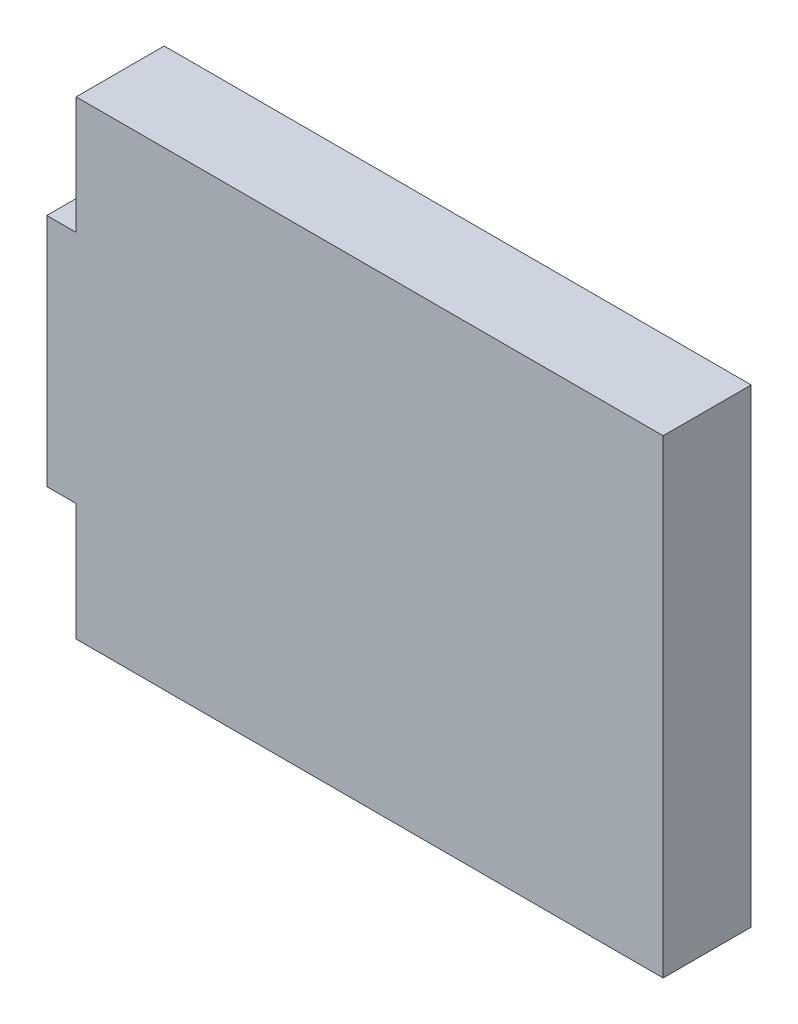
ISO-10303-21;
HEADER;
FILE_DESCRIPTION(('STEP AP214'),'2;1');
FILE_NAME('part.step','',(''),(''),'','','');
FILE_SCHEMA(('AUTOMOTIVE_DESIGN { 1 0 10303 214 1 1 1 1 }'));
ENDSEC;
DATA;
#1=APPLICATION_CONTEXT('core data for automotive mechanical design processes');
#2=APPLICATION_PROTOCOL_DEFINITION('international standard','automotive_design',2000,#1);
#3=PRODUCT_CONTEXT('',#1,'mechanical');
#4=PRODUCT('Part','Part','',(#3));
#5=PRODUCT_RELATED_PRODUCT_CATEGORY('part','',(#4));
#6=PRODUCT_DEFINITION_FORMATION('','',#4);
#7=PRODUCT_DEFINITION_CONTEXT('part definition',#1,'design');
#8=PRODUCT_DEFINITION('design','',#6,#7);
#9=PRODUCT_DEFINITION_SHAPE('','',#8);
#10=(LENGTH_UNIT() NAMED_UNIT(*) SI_UNIT(.MILLI.,.METRE.));
#11=(NAMED_UNIT(*) PLANE_ANGLE_UNIT() SI_UNIT($,.RADIAN.));
#12=(NAMED_UNIT(*) SI_UNIT($,.STERADIAN.) SOLID_ANGLE_UNIT());
#13=UNCERTAINTY_MEASURE_WITH_UNIT(LENGTH_MEASURE(1.E-05),#10,'distance_accuracy_value','');
#14=(GEOMETRIC_REPRESENTATION_CONTEXT(3) GLOBAL_UNCERTAINTY_ASSIGNED_CONTEXT((#13)) GLOBAL_UNIT_ASSIGNED_CONTEXT((#10,
#11,#12)) REPRESENTATION_CONTEXT('',''));
#15=CARTESIAN_POINT('',(0.,0.,0.));
#16=DIRECTION('',(0.,0.,1.));
#17=DIRECTION('',(1.,0.,0.));
#18=AXIS2_PLACEMENT_3D('',#15,#16,#17);
#19=CARTESIAN_POINT('',(-19.095,-10.35,2.));
#20=DIRECTION('',(0.,1.,0.));
#21=DIRECTION('',(0.,0.,1.));
#22=AXIS2_PLACEMENT_3D('',#19,#20,#21);
#23=PLANE('',#22);
#24=DIRECTION('',(0.,0.,-1.));
#25=VECTOR('',#24,1.);
#26=CARTESIAN_POINT('',(-19.095,-10.35,2.));
#27=LINE('',#26,#25);
#28=CARTESIAN_POINT('',(-19.095,-10.35,5.));
#29=VERTEX_POINT('',#28);
#30=CARTESIAN_POINT('',(-19.095,-10.35,2.));
#31=VERTEX_POINT('',#30);
#32=EDGE_CURVE('E120',#29,#31,#27,.T.);
#33=ORIENTED_EDGE('',*,*,#32,.T.);
#34=DIRECTION('',(1.,0.,0.));
#35=VECTOR('',#34,1.);
#36=CARTESIAN_POINT('',(-19.095,-10.35,2.));
#37=LINE('',#36,#35);
#38=CARTESIAN_POINT('',(-18.095,-10.35,2.));
#39=VERTEX_POINT('',#38);
#40=EDGE_CURVE('E20',#39,#31,#37,.F.);
#41=ORIENTED_EDGE('',*,*,#40,.F.);
#42=DIRECTION('',(0.,0.,-1.));
#43=VECTOR('',#42,1.);
#44=CARTESIAN_POINT('',(-18.095,-10.35,2.));
#45=LINE('',#44,#43);
#46=CARTESIAN_POINT('',(-18.095,-10.35,5.));
#47=VERTEX_POINT('',#46);
#48=EDGE_CURVE('E147',#39,#47,#45,.F.);
#49=ORIENTED_EDGE('',*,*,#48,.T.);
#50=DIRECTION('',(-1.,0.,0.));
#51=VECTOR('',#50,1.);
#52=CARTESIAN_POINT('',(1.905,-10.35,5.));
#53=LINE('',#52,#51);
#54=EDGE_CURVE('E109',#47,#29,#53,.T.);
#55=ORIENTED_EDGE('',*,*,#54,.T.);
#56=EDGE_LOOP('',(#33,#41,#49,#55));
#57=FACE_BOUND('',#56,.T.);
#58=ADVANCED_FACE('F17',(#57),#23,.F.);
#59=CARTESIAN_POINT('',(-18.095,-2.35,2.));
#60=DIRECTION('',(0.,-1.,0.));
#61=DIRECTION('',(0.,0.,-1.));
#62=AXIS2_PLACEMENT_3D('',#59,#60,#61);
#63=PLANE('',#62);
#64=DIRECTION('',(0.,0.,-1.));
#65=VECTOR('',#64,1.);
#66=CARTESIAN_POINT('',(-18.095,-2.35,2.));
#67=LINE('',#66,#65);
#68=CARTESIAN_POINT('',(-18.095,-2.35,5.));
#69=VERTEX_POINT('',#68);
#70=CARTESIAN_POINT('',(-18.095,-2.35,2.));
#71=VERTEX_POINT('',#70);
#72=EDGE_CURVE('E141',#69,#71,#67,.T.);
#73=ORIENTED_EDGE('',*,*,#72,.T.);
#74=DIRECTION('',(1.,0.,0.));
#75=VECTOR('',#74,1.);
#76=CARTESIAN_POINT('',(-18.095,-2.35,2.));
#77=LINE('',#76,#75);
#78=CARTESIAN_POINT('',(-19.095,-2.35,2.));
#79=VERTEX_POINT('',#78);
#80=EDGE_CURVE('E34',#79,#71,#77,.T.);
#81=ORIENTED_EDGE('',*,*,#80,.F.);
#82=DIRECTION('',(0.,0.,-1.));
#83=VECTOR('',#82,1.);
#84=CARTESIAN_POINT('',(-19.095,-2.35,2.));
#85=LINE('',#84,#83);
#86=CARTESIAN_POINT('',(-19.095,-2.35,5.));
#87=VERTEX_POINT('',#86);
#88=EDGE_CURVE('E125',#79,#87,#85,.F.);
#89=ORIENTED_EDGE('',*,*,#88,.T.);
#90=DIRECTION('',(-1.,0.,0.));
#91=VECTOR('',#90,1.);
#92=CARTESIAN_POINT('',(1.905,-2.35,5.));
#93=LINE('',#92,#91);
#94=EDGE_CURVE('E92',#87,#69,#93,.F.);
#95=ORIENTED_EDGE('',*,*,#94,.T.);
#96=EDGE_LOOP('',(#73,#81,#89,#95));
#97=FACE_BOUND('',#96,.T.);
#98=ADVANCED_FACE('F160',(#97),#63,.F.);
#99=CARTESIAN_POINT('',(1.905,1.65,5.));
#100=DIRECTION('',(0.,0.,-1.));
#101=DIRECTION('',(-1.,0.,0.));
#102=AXIS2_PLACEMENT_3D('',#99,#100,#101);
#103=PLANE('',#102);
#104=ORIENTED_EDGE('',*,*,#94,.F.);
#105=DIRECTION('',(0.,1.,0.));
#106=VECTOR('',#105,1.);
#107=CARTESIAN_POINT('',(-19.095,-2.35,5.));
#108=LINE('',#107,#106);
#109=EDGE_CURVE('E143',#87,#29,#108,.F.);
#110=ORIENTED_EDGE('',*,*,#109,.T.);
#111=ORIENTED_EDGE('',*,*,#54,.F.);
#112=DIRECTION('',(0.,1.,0.));
#113=VECTOR('',#112,1.);
#114=CARTESIAN_POINT('',(-18.095,-10.35,5.));
#115=LINE('',#114,#113);
#116=CARTESIAN_POINT('',(-18.095,-14.35,5.));
#117=VERTEX_POINT('',#116);
#118=EDGE_CURVE('E126',#47,#117,#115,.F.);
#119=ORIENTED_EDGE('',*,*,#118,.T.);
#120=DIRECTION('',(1.,0.,0.));
#121=VECTOR('',#120,1.);
#122=CARTESIAN_POINT('',(-18.095,-14.35,5.));
#123=LINE('',#122,#121);
#124=CARTESIAN_POINT('',(1.905,-14.35,5.));
#125=VERTEX_POINT('',#124);
#126=EDGE_CURVE('E97',#117,#125,#123,.T.);
#127=ORIENTED_EDGE('',*,*,#126,.T.);
#128=DIRECTION('',(0.,1.,0.));
#129=VECTOR('',#128,1.);
#130=CARTESIAN_POINT('',(1.905,-14.35,5.));
#131=LINE('',#130,#129);
#132=CARTESIAN_POINT('',(1.905,1.65,5.));
#133=VERTEX_POINT('',#132);
#134=EDGE_CURVE('E78',#125,#133,#131,.T.);
#135=ORIENTED_EDGE('',*,*,#134,.T.);
#136=DIRECTION('',(1.,0.,0.));
#137=VECTOR('',#136,1.);
#138=CARTESIAN_POINT('',(1.905,1.65,5.));
#139=LINE('',#138,#137);
#140=CARTESIAN_POINT('',(-18.095,1.65,5.));
#141=VERTEX_POINT('',#140);
#142=EDGE_CURVE('E83',#133,#141,#139,.F.);
#143=ORIENTED_EDGE('',*,*,#142,.T.);
#144=DIRECTION('',(0.,1.,0.));
#145=VECTOR('',#144,1.);
#146=CARTESIAN_POINT('',(-18.095,1.65,5.));
#147=LINE('',#146,#145);
#148=EDGE_CURVE('E138',#141,#69,#147,.F.);
#149=ORIENTED_EDGE('',*,*,#148,.T.);
#150=EDGE_LOOP('',(#104,#110,#111,#119,#127,#135,#143,#149));
#151=FACE_BOUND('',#150,.T.);
#152=ADVANCED_FACE('F95',(#151),#103,.F.);
#153=CARTESIAN_POINT('',(1.905,1.65,2.));
#154=DIRECTION('',(0.,-1.,0.));
#155=DIRECTION('',(0.,0.,-1.));
#156=AXIS2_PLACEMENT_3D('',#153,#154,#155);
#157=PLANE('',#156);
#158=DIRECTION('',(0.,0.,1.));
#159=VECTOR('',#158,1.);
#160=CARTESIAN_POINT('',(1.905,1.65,2.));
#161=LINE('',#160,#159);
#162=CARTESIAN_POINT('',(1.905,1.65,2.));
#163=VERTEX_POINT('',#162);
#164=EDGE_CURVE('E85',#133,#163,#161,.F.);
#165=ORIENTED_EDGE('',*,*,#164,.T.);
#166=DIRECTION('',(-1.,0.,0.));
#167=VECTOR('',#166,1.);
#168=CARTESIAN_POINT('',(1.905,1.65,2.));
#169=LINE('',#168,#167);
#170=CARTESIAN_POINT('',(-18.095,1.65,2.));
#171=VERTEX_POINT('',#170);
#172=EDGE_CURVE('E136',#171,#163,#169,.F.);
#173=ORIENTED_EDGE('',*,*,#172,.F.);
#174=DIRECTION('',(0.,0.,-1.));
#175=VECTOR('',#174,1.);
#176=CARTESIAN_POINT('',(-18.095,1.65,2.));
#177=LINE('',#176,#175);
#178=EDGE_CURVE('E88',#171,#141,#177,.F.);
#179=ORIENTED_EDGE('',*,*,#178,.T.);
#180=ORIENTED_EDGE('',*,*,#142,.F.);
#181=EDGE_LOOP('',(#165,#173,#179,#180));
#182=FACE_BOUND('',#181,.T.);
#183=ADVANCED_FACE('F84',(#182),#157,.F.);
#184=CARTESIAN_POINT('',(1.905,-14.35,2.));
#185=DIRECTION('',(-1.,0.,0.));
#186=DIRECTION('',(0.,0.,1.));
#187=AXIS2_PLACEMENT_3D('',#184,#185,#186);
#188=PLANE('',#187);
#189=DIRECTION('',(0.,0.,1.));
#190=VECTOR('',#189,1.);
#191=CARTESIAN_POINT('',(1.905,-14.35,2.));
#192=LINE('',#191,#190);
#193=CARTESIAN_POINT('',(1.905,-14.35,2.));
#194=VERTEX_POINT('',#193);
#195=EDGE_CURVE('E99',#125,#194,#192,.F.);
#196=ORIENTED_EDGE('',*,*,#195,.T.);
#197=DIRECTION('',(0.,1.,0.));
#198=VECTOR('',#197,1.);
#199=CARTESIAN_POINT('',(1.905,1.65,2.));
#200=LINE('',#199,#198);
#201=EDGE_CURVE('E103',#163,#194,#200,.F.);
#202=ORIENTED_EDGE('',*,*,#201,.F.);
#203=ORIENTED_EDGE('',*,*,#164,.F.);
#204=ORIENTED_EDGE('',*,*,#134,.F.);
#205=EDGE_LOOP('',(#196,#202,#203,#204));
#206=FACE_BOUND('',#205,.T.);
#207=ADVANCED_FACE('F101',(#206),#188,.F.);
#208=CARTESIAN_POINT('',(-18.095,-14.35,2.));
#209=DIRECTION('',(0.,1.,0.));
#210=DIRECTION('',(0.,0.,1.));
#211=AXIS2_PLACEMENT_3D('',#208,#209,#210);
#212=PLANE('',#211);
#213=DIRECTION('',(0.,0.,-1.));
#214=VECTOR('',#213,1.);
#215=CARTESIAN_POINT('',(-18.095,-14.35,2.));
#216=LINE('',#215,#214);
#217=CARTESIAN_POINT('',(-18.095,-14.35,2.));
#218=VERTEX_POINT('',#217);
#219=EDGE_CURVE('E149',#117,#218,#216,.T.);
#220=ORIENTED_EDGE('',*,*,#219,.T.);
#221=DIRECTION('',(-1.,0.,0.));
#222=VECTOR('',#221,1.);
#223=CARTESIAN_POINT('',(1.905,-14.35,2.));
#224=LINE('',#223,#222);
#225=EDGE_CURVE('E131',#194,#218,#224,.T.);
#226=ORIENTED_EDGE('',*,*,#225,.F.);
#227=ORIENTED_EDGE('',*,*,#195,.F.);
#228=ORIENTED_EDGE('',*,*,#126,.F.);
#229=EDGE_LOOP('',(#220,#226,#227,#228));
#230=FACE_BOUND('',#229,.T.);
#231=ADVANCED_FACE('F153',(#230),#212,.F.);
#232=CARTESIAN_POINT('',(-18.095,-10.35,2.));
#233=DIRECTION('',(1.,0.,0.));
#234=DIRECTION('',(0.,0.,-1.));
#235=AXIS2_PLACEMENT_3D('',#232,#233,#234);
#236=PLANE('',#235);
#237=ORIENTED_EDGE('',*,*,#48,.F.);
#238=DIRECTION('',(0.,1.,0.));
#239=VECTOR('',#238,1.);
#240=CARTESIAN_POINT('',(-18.095,1.65,2.));
#241=LINE('',#240,#239);
#242=EDGE_CURVE('E116',#218,#39,#241,.T.);
#243=ORIENTED_EDGE('',*,*,#242,.F.);
#244=ORIENTED_EDGE('',*,*,#219,.F.);
#245=ORIENTED_EDGE('',*,*,#118,.F.);
#246=EDGE_LOOP('',(#237,#243,#244,#245));
#247=FACE_BOUND('',#246,.T.);
#248=ADVANCED_FACE('F177',(#247),#236,.F.);
#249=CARTESIAN_POINT('',(-19.095,-2.35,2.));
#250=DIRECTION('',(1.,0.,0.));
#251=DIRECTION('',(0.,0.,-1.));
#252=AXIS2_PLACEMENT_3D('',#249,#250,#251);
#253=PLANE('',#252);
#254=ORIENTED_EDGE('',*,*,#88,.F.);
#255=DIRECTION('',(0.,1.,0.));
#256=VECTOR('',#255,1.);
#257=CARTESIAN_POINT('',(-19.095,1.65,2.));
#258=LINE('',#257,#256);
#259=EDGE_CURVE('E26',#31,#79,#258,.T.);
#260=ORIENTED_EDGE('',*,*,#259,.F.);
#261=ORIENTED_EDGE('',*,*,#32,.F.);
#262=ORIENTED_EDGE('',*,*,#109,.F.);
#263=EDGE_LOOP('',(#254,#260,#261,#262));
#264=FACE_BOUND('',#263,.T.);
#265=ADVANCED_FACE('F129',(#264),#253,.F.);
#266=CARTESIAN_POINT('',(-18.095,1.65,2.));
#267=DIRECTION('',(1.,0.,0.));
#268=DIRECTION('',(0.,0.,-1.));
#269=AXIS2_PLACEMENT_3D('',#266,#267,#268);
#270=PLANE('',#269);
#271=ORIENTED_EDGE('',*,*,#178,.F.);
#272=DIRECTION('',(0.,1.,0.));
#273=VECTOR('',#272,1.);
#274=CARTESIAN_POINT('',(-18.095,1.65,2.));
#275=LINE('',#274,#273);
#276=EDGE_CURVE('E11',#71,#171,#275,.T.);
#277=ORIENTED_EDGE('',*,*,#276,.F.);
#278=ORIENTED_EDGE('',*,*,#72,.F.);
#279=ORIENTED_EDGE('',*,*,#148,.F.);
#280=EDGE_LOOP('',(#271,#277,#278,#279));
#281=FACE_BOUND('',#280,.T.);
#282=ADVANCED_FACE('F157',(#281),#270,.F.);
#283=CARTESIAN_POINT('',(1.905,1.65,2.));
#284=DIRECTION('',(0.,0.,-1.));
#285=DIRECTION('',(-1.,0.,0.));
#286=AXIS2_PLACEMENT_3D('',#283,#284,#285);
#287=PLANE('',#286);
#288=ORIENTED_EDGE('',*,*,#80,.T.);
#289=ORIENTED_EDGE('',*,*,#276,.T.);
#290=ORIENTED_EDGE('',*,*,#172,.T.);
#291=ORIENTED_EDGE('',*,*,#201,.T.);
#292=ORIENTED_EDGE('',*,*,#225,.T.);
#293=ORIENTED_EDGE('',*,*,#242,.T.);
#294=ORIENTED_EDGE('',*,*,#40,.T.);
#295=ORIENTED_EDGE('',*,*,#259,.T.);
#296=EDGE_LOOP('',(#288,#289,#290,#291,#292,#293,#294,#295));
#297=FACE_BOUND('',#296,.T.);
#298=ADVANCED_FACE('F112',(#297),#287,.T.);
#299=CLOSED_SHELL('',(#58,#98,#152,#183,#207,#231,#248,#265,#282,#298));
#300=MANIFOLD_SOLID_BREP('B1',#299);
#301=ADVANCED_BREP_SHAPE_REPRESENTATION('',(#18,#300),#14);
#302=SHAPE_DEFINITION_REPRESENTATION(#9,#301);
ENDSEC;
END-ISO-10303-21;
